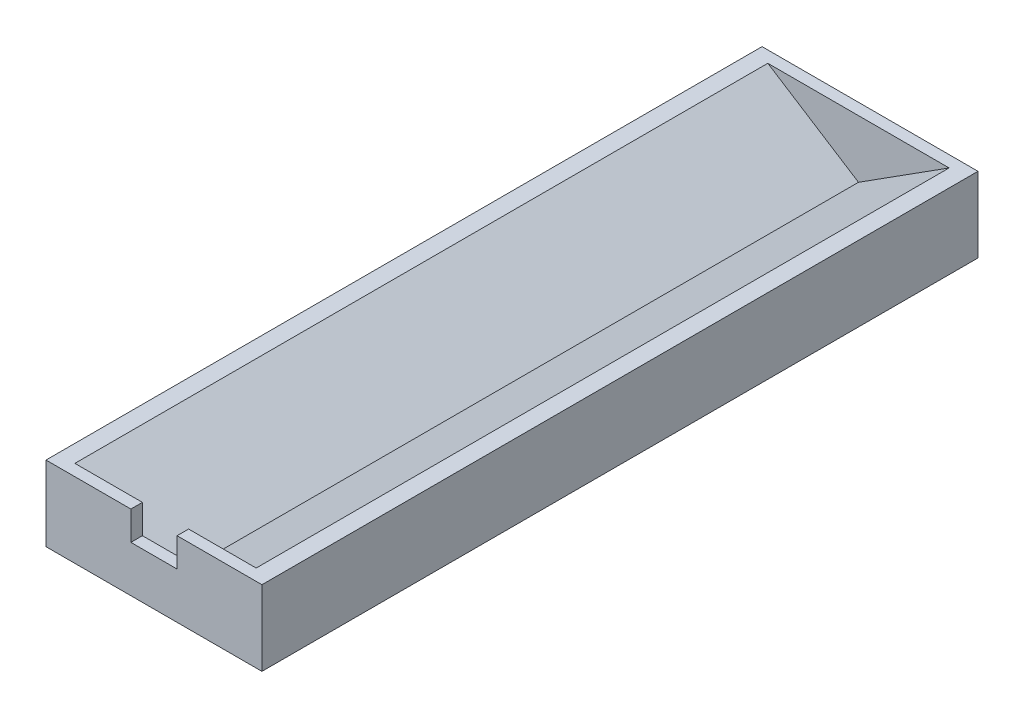
ISO-10303-21;
HEADER;
FILE_DESCRIPTION(('STEP AP214'),'2;1');
FILE_NAME('part.step','',(''),(''),'','','');
FILE_SCHEMA(('AUTOMOTIVE_DESIGN { 1 0 10303 214 1 1 1 1 }'));
ENDSEC;
DATA;
#1=APPLICATION_CONTEXT('core data for automotive mechanical design processes');
#2=APPLICATION_PROTOCOL_DEFINITION('international standard','automotive_design',2000,#1);
#3=PRODUCT_CONTEXT('',#1,'mechanical');
#4=PRODUCT('Part','Part','',(#3));
#5=PRODUCT_RELATED_PRODUCT_CATEGORY('part','',(#4));
#6=PRODUCT_DEFINITION_FORMATION('','',#4);
#7=PRODUCT_DEFINITION_CONTEXT('part definition',#1,'design');
#8=PRODUCT_DEFINITION('design','',#6,#7);
#9=PRODUCT_DEFINITION_SHAPE('','',#8);
#10=(LENGTH_UNIT() NAMED_UNIT(*) SI_UNIT(.MILLI.,.METRE.));
#11=(NAMED_UNIT(*) PLANE_ANGLE_UNIT() SI_UNIT($,.RADIAN.));
#12=(NAMED_UNIT(*) SI_UNIT($,.STERADIAN.) SOLID_ANGLE_UNIT());
#13=UNCERTAINTY_MEASURE_WITH_UNIT(LENGTH_MEASURE(1.E-05),#10,'distance_accuracy_value','');
#14=(GEOMETRIC_REPRESENTATION_CONTEXT(3) GLOBAL_UNCERTAINTY_ASSIGNED_CONTEXT((#13)) GLOBAL_UNIT_ASSIGNED_CONTEXT((#10,
#11,#12)) REPRESENTATION_CONTEXT('',''));
#15=CARTESIAN_POINT('',(0.,0.,0.));
#16=DIRECTION('',(0.,0.,1.));
#17=DIRECTION('',(1.,0.,0.));
#18=AXIS2_PLACEMENT_3D('',#15,#16,#17);
#19=CARTESIAN_POINT('',(-18.6968557711749,13.,120.));
#20=DIRECTION('',(1.,0.,0.));
#21=DIRECTION('',(0.,1.,0.));
#22=AXIS2_PLACEMENT_3D('',#19,#20,#21);
#23=PLANE('',#22);
#24=DIRECTION('',(0.,0.,-1.));
#25=VECTOR('',#24,1.);
#26=CARTESIAN_POINT('',(-18.6968557711749,13.,120.));
#27=LINE('',#26,#25);
#28=CARTESIAN_POINT('',(-18.6968557711749,13.,122.));
#29=VERTEX_POINT('',#28);
#30=CARTESIAN_POINT('',(-18.6968557711749,13.,-2.));
#31=VERTEX_POINT('',#30);
#32=EDGE_CURVE('E188',#29,#31,#27,.T.);
#33=ORIENTED_EDGE('',*,*,#32,.T.);
#34=DIRECTION('',(0.,1.,0.));
#35=VECTOR('',#34,1.);
#36=CARTESIAN_POINT('',(-18.6968557711749,0.,-2.));
#37=LINE('',#36,#35);
#38=CARTESIAN_POINT('',(-18.6968557711749,0.,-2.));
#39=VERTEX_POINT('',#38);
#40=EDGE_CURVE('E195',#39,#31,#37,.T.);
#41=ORIENTED_EDGE('',*,*,#40,.F.);
#42=DIRECTION('',(0.,0.,-1.));
#43=VECTOR('',#42,1.);
#44=CARTESIAN_POINT('',(-18.6968557711749,0.,120.));
#45=LINE('',#44,#43);
#46=CARTESIAN_POINT('',(-18.6968557711749,0.,122.));
#47=VERTEX_POINT('',#46);
#48=EDGE_CURVE('E172',#47,#39,#45,.T.);
#49=ORIENTED_EDGE('',*,*,#48,.F.);
#50=DIRECTION('',(0.,-1.,0.));
#51=VECTOR('',#50,1.);
#52=CARTESIAN_POINT('',(-18.6968557711749,0.,122.));
#53=LINE('',#52,#51);
#54=EDGE_CURVE('E149',#29,#47,#53,.T.);
#55=ORIENTED_EDGE('',*,*,#54,.F.);
#56=EDGE_LOOP('',(#33,#41,#49,#55));
#57=FACE_BOUND('',#56,.T.);
#58=ADVANCED_FACE('F32',(#57),#23,.F.);
#59=CARTESIAN_POINT('',(-18.6968557711749,0.,120.));
#60=DIRECTION('',(0.,1.,0.));
#61=DIRECTION('',(-1.,0.,0.));
#62=AXIS2_PLACEMENT_3D('',#59,#60,#61);
#63=PLANE('',#62);
#64=ORIENTED_EDGE('',*,*,#48,.T.);
#65=DIRECTION('',(-1.,0.,0.));
#66=VECTOR('',#65,1.);
#67=CARTESIAN_POINT('',(18.6968557711749,0.,-2.));
#68=LINE('',#67,#66);
#69=CARTESIAN_POINT('',(18.6968557711749,0.,-2.));
#70=VERTEX_POINT('',#69);
#71=EDGE_CURVE('E202',#70,#39,#68,.T.);
#72=ORIENTED_EDGE('',*,*,#71,.F.);
#73=DIRECTION('',(0.,0.,-1.));
#74=VECTOR('',#73,1.);
#75=CARTESIAN_POINT('',(18.6968557711749,0.,120.));
#76=LINE('',#75,#74);
#77=CARTESIAN_POINT('',(18.6968557711749,0.,122.));
#78=VERTEX_POINT('',#77);
#79=EDGE_CURVE('E199',#78,#70,#76,.T.);
#80=ORIENTED_EDGE('',*,*,#79,.F.);
#81=DIRECTION('',(1.,0.,0.));
#82=VECTOR('',#81,1.);
#83=CARTESIAN_POINT('',(-18.6968557711749,0.,122.));
#84=LINE('',#83,#82);
#85=EDGE_CURVE('E152',#47,#78,#84,.T.);
#86=ORIENTED_EDGE('',*,*,#85,.F.);
#87=EDGE_LOOP('',(#64,#72,#80,#86));
#88=FACE_BOUND('',#87,.T.);
#89=ADVANCED_FACE('F201',(#88),#63,.F.);
#90=CARTESIAN_POINT('',(18.6968557711749,0.,120.));
#91=DIRECTION('',(-1.,0.,0.));
#92=DIRECTION('',(0.,-1.,0.));
#93=AXIS2_PLACEMENT_3D('',#90,#91,#92);
#94=PLANE('',#93);
#95=ORIENTED_EDGE('',*,*,#79,.T.);
#96=DIRECTION('',(0.,-1.,0.));
#97=VECTOR('',#96,1.);
#98=CARTESIAN_POINT('',(18.6968557711749,0.,-2.));
#99=LINE('',#98,#97);
#100=CARTESIAN_POINT('',(18.6968557711749,13.,-2.));
#101=VERTEX_POINT('',#100);
#102=EDGE_CURVE('E239',#101,#70,#99,.T.);
#103=ORIENTED_EDGE('',*,*,#102,.F.);
#104=DIRECTION('',(0.,0.,-1.));
#105=VECTOR('',#104,1.);
#106=CARTESIAN_POINT('',(18.6968557711749,13.,120.));
#107=LINE('',#106,#105);
#108=CARTESIAN_POINT('',(18.6968557711749,13.,122.));
#109=VERTEX_POINT('',#108);
#110=EDGE_CURVE('E206',#109,#101,#107,.T.);
#111=ORIENTED_EDGE('',*,*,#110,.F.);
#112=DIRECTION('',(0.,1.,0.));
#113=VECTOR('',#112,1.);
#114=CARTESIAN_POINT('',(18.6968557711749,0.,122.));
#115=LINE('',#114,#113);
#116=EDGE_CURVE('E156',#78,#109,#115,.T.);
#117=ORIENTED_EDGE('',*,*,#116,.F.);
#118=EDGE_LOOP('',(#95,#103,#111,#117));
#119=FACE_BOUND('',#118,.T.);
#120=ADVANCED_FACE('F238',(#119),#94,.F.);
#121=CARTESIAN_POINT('',(15.6968557711749,13.,120.));
#122=DIRECTION('',(0.537299608346824,-0.843391445812886,0.));
#123=DIRECTION('',(0.843391445812886,0.537299608346824,0.));
#124=AXIS2_PLACEMENT_3D('',#121,#122,#123);
#125=PLANE('',#124);
#126=DIRECTION('',(-0.843391445812886,-0.537299608346824,0.));
#127=VECTOR('',#126,1.);
#128=CARTESIAN_POINT('',(15.6968557711749,13.,0.));
#129=LINE('',#128,#127);
#130=CARTESIAN_POINT('',(15.6968557711749,13.,0.));
#131=VERTEX_POINT('',#130);
#132=CARTESIAN_POINT('',(0.,2.99999999999999,0.));
#133=VERTEX_POINT('',#132);
#134=EDGE_CURVE('E69',#131,#133,#129,.T.);
#135=ORIENTED_EDGE('',*,*,#134,.T.);
#136=DIRECTION('',(0.,0.,-1.));
#137=VECTOR('',#136,1.);
#138=CARTESIAN_POINT('',(0.,2.99999999999999,120.));
#139=LINE('',#138,#137);
#140=CARTESIAN_POINT('',(0.,2.99999999999999,120.));
#141=VERTEX_POINT('',#140);
#142=EDGE_CURVE('E55',#141,#133,#139,.T.);
#143=ORIENTED_EDGE('',*,*,#142,.F.);
#144=DIRECTION('',(-0.843391445812886,-0.537299608346824,0.));
#145=VECTOR('',#144,1.);
#146=CARTESIAN_POINT('',(15.6968557711749,13.,120.));
#147=LINE('',#146,#145);
#148=CARTESIAN_POINT('',(15.6968557711749,13.,120.));
#149=VERTEX_POINT('',#148);
#150=EDGE_CURVE('E222',#149,#141,#147,.T.);
#151=ORIENTED_EDGE('',*,*,#150,.F.);
#152=DIRECTION('',(0.,0.,-1.));
#153=VECTOR('',#152,1.);
#154=CARTESIAN_POINT('',(15.6968557711749,13.,120.));
#155=LINE('',#154,#153);
#156=EDGE_CURVE('E208',#149,#131,#155,.T.);
#157=ORIENTED_EDGE('',*,*,#156,.T.);
#158=EDGE_LOOP('',(#135,#143,#151,#157));
#159=FACE_BOUND('',#158,.T.);
#160=ADVANCED_FACE('F236',(#159),#125,.F.);
#161=CARTESIAN_POINT('',(0.,2.99999999999999,120.));
#162=DIRECTION('',(-0.537299608346824,-0.843391445812886,0.));
#163=DIRECTION('',(0.843391445812886,-0.537299608346824,0.));
#164=AXIS2_PLACEMENT_3D('',#161,#162,#163);
#165=PLANE('',#164);
#166=DIRECTION('',(-0.843391445812886,0.537299608346824,0.));
#167=VECTOR('',#166,1.);
#168=CARTESIAN_POINT('',(0.,2.99999999999999,0.));
#169=LINE('',#168,#167);
#170=CARTESIAN_POINT('',(-15.6968557711749,13.,0.));
#171=VERTEX_POINT('',#170);
#172=EDGE_CURVE('E67',#133,#171,#169,.T.);
#173=ORIENTED_EDGE('',*,*,#172,.T.);
#174=DIRECTION('',(0.,0.,-1.));
#175=VECTOR('',#174,1.);
#176=CARTESIAN_POINT('',(-15.6968557711749,13.,120.));
#177=LINE('',#176,#175);
#178=CARTESIAN_POINT('',(-15.696855771175,13.,120.));
#179=VERTEX_POINT('',#178);
#180=EDGE_CURVE('E223',#179,#171,#177,.T.);
#181=ORIENTED_EDGE('',*,*,#180,.F.);
#182=DIRECTION('',(-0.843391445812886,0.537299608346824,0.));
#183=VECTOR('',#182,1.);
#184=CARTESIAN_POINT('',(0.,2.99999999999999,120.));
#185=LINE('',#184,#183);
#186=EDGE_CURVE('E230',#141,#179,#185,.T.);
#187=ORIENTED_EDGE('',*,*,#186,.F.);
#188=ORIENTED_EDGE('',*,*,#142,.T.);
#189=EDGE_LOOP('',(#173,#181,#187,#188));
#190=FACE_BOUND('',#189,.T.);
#191=ADVANCED_FACE('F232',(#190),#165,.F.);
#192=CARTESIAN_POINT('',(-15.6968557711749,13.,120.));
#193=DIRECTION('',(0.,-1.,0.));
#194=DIRECTION('',(0.,0.,-1.));
#195=AXIS2_PLACEMENT_3D('',#192,#193,#194);
#196=PLANE('',#195);
#197=DIRECTION('',(-1.,0.,0.));
#198=VECTOR('',#197,1.);
#199=CARTESIAN_POINT('',(-18.6968557711749,13.,122.));
#200=LINE('',#199,#198);
#201=CARTESIAN_POINT('',(-4.,13.,122.));
#202=VERTEX_POINT('',#201);
#203=EDGE_CURVE('E159',#202,#29,#200,.T.);
#204=ORIENTED_EDGE('',*,*,#203,.F.);
#205=DIRECTION('',(0.,0.,1.));
#206=VECTOR('',#205,1.);
#207=CARTESIAN_POINT('',(-4.,13.,119.));
#208=LINE('',#207,#206);
#209=CARTESIAN_POINT('',(-4.,13.,120.));
#210=VERTEX_POINT('',#209);
#211=EDGE_CURVE('E134',#210,#202,#208,.T.);
#212=ORIENTED_EDGE('',*,*,#211,.F.);
#213=DIRECTION('',(-1.,0.,0.));
#214=VECTOR('',#213,1.);
#215=CARTESIAN_POINT('',(-18.6968557711749,13.,120.));
#216=LINE('',#215,#214);
#217=EDGE_CURVE('E144',#210,#179,#216,.T.);
#218=ORIENTED_EDGE('',*,*,#217,.T.);
#219=ORIENTED_EDGE('',*,*,#180,.T.);
#220=DIRECTION('',(1.,0.,0.));
#221=VECTOR('',#220,1.);
#222=CARTESIAN_POINT('',(18.6968557711749,13.,0.));
#223=LINE('',#222,#221);
#224=EDGE_CURVE('E162',#171,#131,#223,.T.);
#225=ORIENTED_EDGE('',*,*,#224,.T.);
#226=ORIENTED_EDGE('',*,*,#156,.F.);
#227=CARTESIAN_POINT('',(4.,13.,120.));
#228=VERTEX_POINT('',#227);
#229=EDGE_CURVE('E153',#149,#228,#216,.T.);
#230=ORIENTED_EDGE('',*,*,#229,.T.);
#231=DIRECTION('',(0.,0.,1.));
#232=VECTOR('',#231,1.);
#233=CARTESIAN_POINT('',(4.,13.,119.));
#234=LINE('',#233,#232);
#235=CARTESIAN_POINT('',(4.,13.,122.));
#236=VERTEX_POINT('',#235);
#237=EDGE_CURVE('E145',#228,#236,#234,.T.);
#238=ORIENTED_EDGE('',*,*,#237,.T.);
#239=EDGE_CURVE('E160',#109,#236,#200,.T.);
#240=ORIENTED_EDGE('',*,*,#239,.F.);
#241=ORIENTED_EDGE('',*,*,#110,.T.);
#242=DIRECTION('',(1.,0.,0.));
#243=VECTOR('',#242,1.);
#244=CARTESIAN_POINT('',(18.6968557711749,13.,-2.));
#245=LINE('',#244,#243);
#246=EDGE_CURVE('E213',#31,#101,#245,.T.);
#247=ORIENTED_EDGE('',*,*,#246,.F.);
#248=ORIENTED_EDGE('',*,*,#32,.F.);
#249=EDGE_LOOP('',(#204,#212,#218,#219,#225,#226,#230,#238,#240,#241,#247,#248));
#250=FACE_BOUND('',#249,.T.);
#251=ADVANCED_FACE('F183',(#250),#196,.F.);
#252=CARTESIAN_POINT('',(0.,0.,0.));
#253=DIRECTION('',(0.,0.,1.));
#254=DIRECTION('',(1.,0.,0.));
#255=AXIS2_PLACEMENT_3D('',#252,#253,#254);
#256=PLANE('',#255);
#257=ORIENTED_EDGE('',*,*,#172,.F.);
#258=ORIENTED_EDGE('',*,*,#134,.F.);
#259=ORIENTED_EDGE('',*,*,#224,.F.);
#260=EDGE_LOOP('',(#257,#258,#259));
#261=FACE_BOUND('',#260,.T.);
#262=ADVANCED_FACE('F249',(#261),#256,.T.);
#263=CARTESIAN_POINT('',(0.,0.,-2.));
#264=DIRECTION('',(0.,0.,1.));
#265=DIRECTION('',(1.,0.,0.));
#266=AXIS2_PLACEMENT_3D('',#263,#264,#265);
#267=PLANE('',#266);
#268=ORIENTED_EDGE('',*,*,#102,.T.);
#269=ORIENTED_EDGE('',*,*,#71,.T.);
#270=ORIENTED_EDGE('',*,*,#40,.T.);
#271=ORIENTED_EDGE('',*,*,#246,.T.);
#272=EDGE_LOOP('',(#268,#269,#270,#271));
#273=FACE_BOUND('',#272,.T.);
#274=ADVANCED_FACE('F242',(#273),#267,.F.);
#275=CARTESIAN_POINT('',(0.,0.,122.));
#276=DIRECTION('',(0.,0.,-1.));
#277=DIRECTION('',(-1.,0.,0.));
#278=AXIS2_PLACEMENT_3D('',#275,#276,#277);
#279=PLANE('',#278);
#280=DIRECTION('',(1.,0.,0.));
#281=VECTOR('',#280,1.);
#282=CARTESIAN_POINT('',(-4.,8.00000000000001,122.));
#283=LINE('',#282,#281);
#284=CARTESIAN_POINT('',(-4.,8.00000000000001,122.));
#285=VERTEX_POINT('',#284);
#286=CARTESIAN_POINT('',(4.,8.00000000000001,122.));
#287=VERTEX_POINT('',#286);
#288=EDGE_CURVE('E122',#285,#287,#283,.T.);
#289=ORIENTED_EDGE('',*,*,#288,.F.);
#290=DIRECTION('',(0.,-1.,0.));
#291=VECTOR('',#290,1.);
#292=CARTESIAN_POINT('',(-4.,13.,122.));
#293=LINE('',#292,#291);
#294=EDGE_CURVE('E131',#202,#285,#293,.T.);
#295=ORIENTED_EDGE('',*,*,#294,.F.);
#296=ORIENTED_EDGE('',*,*,#203,.T.);
#297=ORIENTED_EDGE('',*,*,#54,.T.);
#298=ORIENTED_EDGE('',*,*,#85,.T.);
#299=ORIENTED_EDGE('',*,*,#116,.T.);
#300=ORIENTED_EDGE('',*,*,#239,.T.);
#301=DIRECTION('',(0.,1.,0.));
#302=VECTOR('',#301,1.);
#303=CARTESIAN_POINT('',(4.,13.,122.));
#304=LINE('',#303,#302);
#305=EDGE_CURVE('E128',#287,#236,#304,.T.);
#306=ORIENTED_EDGE('',*,*,#305,.F.);
#307=EDGE_LOOP('',(#289,#295,#296,#297,#298,#299,#300,#306));
#308=FACE_BOUND('',#307,.T.);
#309=ADVANCED_FACE('F138',(#308),#279,.F.);
#310=CARTESIAN_POINT('',(0.,0.,120.));
#311=DIRECTION('',(0.,0.,-1.));
#312=DIRECTION('',(-1.,0.,0.));
#313=AXIS2_PLACEMENT_3D('',#310,#311,#312);
#314=PLANE('',#313);
#315=DIRECTION('',(0.,1.,0.));
#316=VECTOR('',#315,1.);
#317=CARTESIAN_POINT('',(-4.,0.,120.));
#318=LINE('',#317,#316);
#319=CARTESIAN_POINT('',(-4.,8.00000000000001,120.));
#320=VERTEX_POINT('',#319);
#321=EDGE_CURVE('E11',#320,#210,#318,.T.);
#322=ORIENTED_EDGE('',*,*,#321,.F.);
#323=DIRECTION('',(-1.,0.,0.));
#324=VECTOR('',#323,1.);
#325=CARTESIAN_POINT('',(0.,8.00000000000001,120.));
#326=LINE('',#325,#324);
#327=CARTESIAN_POINT('',(4.,8.00000000000001,120.));
#328=VERTEX_POINT('',#327);
#329=EDGE_CURVE('E125',#328,#320,#326,.T.);
#330=ORIENTED_EDGE('',*,*,#329,.F.);
#331=DIRECTION('',(0.,-1.,0.));
#332=VECTOR('',#331,1.);
#333=CARTESIAN_POINT('',(4.,0.,120.));
#334=LINE('',#333,#332);
#335=EDGE_CURVE('E39',#228,#328,#334,.T.);
#336=ORIENTED_EDGE('',*,*,#335,.F.);
#337=ORIENTED_EDGE('',*,*,#229,.F.);
#338=ORIENTED_EDGE('',*,*,#150,.T.);
#339=ORIENTED_EDGE('',*,*,#186,.T.);
#340=ORIENTED_EDGE('',*,*,#217,.F.);
#341=EDGE_LOOP('',(#322,#330,#336,#337,#338,#339,#340));
#342=FACE_BOUND('',#341,.T.);
#343=ADVANCED_FACE('F179',(#342),#314,.T.);
#344=CARTESIAN_POINT('',(-4.,13.,119.));
#345=DIRECTION('',(-1.,0.,0.));
#346=DIRECTION('',(0.,-1.,0.));
#347=AXIS2_PLACEMENT_3D('',#344,#345,#346);
#348=PLANE('',#347);
#349=ORIENTED_EDGE('',*,*,#321,.T.);
#350=ORIENTED_EDGE('',*,*,#211,.T.);
#351=ORIENTED_EDGE('',*,*,#294,.T.);
#352=DIRECTION('',(0.,0.,1.));
#353=VECTOR('',#352,1.);
#354=CARTESIAN_POINT('',(-4.,8.00000000000001,119.));
#355=LINE('',#354,#353);
#356=EDGE_CURVE('E118',#320,#285,#355,.T.);
#357=ORIENTED_EDGE('',*,*,#356,.F.);
#358=EDGE_LOOP('',(#349,#350,#351,#357));
#359=FACE_BOUND('',#358,.T.);
#360=ADVANCED_FACE('F132',(#359),#348,.F.);
#361=CARTESIAN_POINT('',(4.,13.,119.));
#362=DIRECTION('',(1.,0.,0.));
#363=DIRECTION('',(0.,1.,0.));
#364=AXIS2_PLACEMENT_3D('',#361,#362,#363);
#365=PLANE('',#364);
#366=ORIENTED_EDGE('',*,*,#335,.T.);
#367=DIRECTION('',(0.,0.,1.));
#368=VECTOR('',#367,1.);
#369=CARTESIAN_POINT('',(4.,8.00000000000001,119.));
#370=LINE('',#369,#368);
#371=EDGE_CURVE('E46',#328,#287,#370,.T.);
#372=ORIENTED_EDGE('',*,*,#371,.T.);
#373=ORIENTED_EDGE('',*,*,#305,.T.);
#374=ORIENTED_EDGE('',*,*,#237,.F.);
#375=EDGE_LOOP('',(#366,#372,#373,#374));
#376=FACE_BOUND('',#375,.T.);
#377=ADVANCED_FACE('F175',(#376),#365,.F.);
#378=CARTESIAN_POINT('',(-4.,8.00000000000001,119.));
#379=DIRECTION('',(0.,-1.,0.));
#380=DIRECTION('',(0.,0.,-1.));
#381=AXIS2_PLACEMENT_3D('',#378,#379,#380);
#382=PLANE('',#381);
#383=ORIENTED_EDGE('',*,*,#329,.T.);
#384=ORIENTED_EDGE('',*,*,#356,.T.);
#385=ORIENTED_EDGE('',*,*,#288,.T.);
#386=ORIENTED_EDGE('',*,*,#371,.F.);
#387=EDGE_LOOP('',(#383,#384,#385,#386));
#388=FACE_BOUND('',#387,.T.);
#389=ADVANCED_FACE('F120',(#388),#382,.F.);
#390=CLOSED_SHELL('',(#58,#89,#120,#160,#191,#251,#262,#274,#309,#343,#360,#377,#389));
#391=MANIFOLD_SOLID_BREP('B2',#390);
#392=ADVANCED_BREP_SHAPE_REPRESENTATION('',(#18,#391),#14);
#393=SHAPE_DEFINITION_REPRESENTATION(#9,#392);
ENDSEC;
END-ISO-10303-21;
